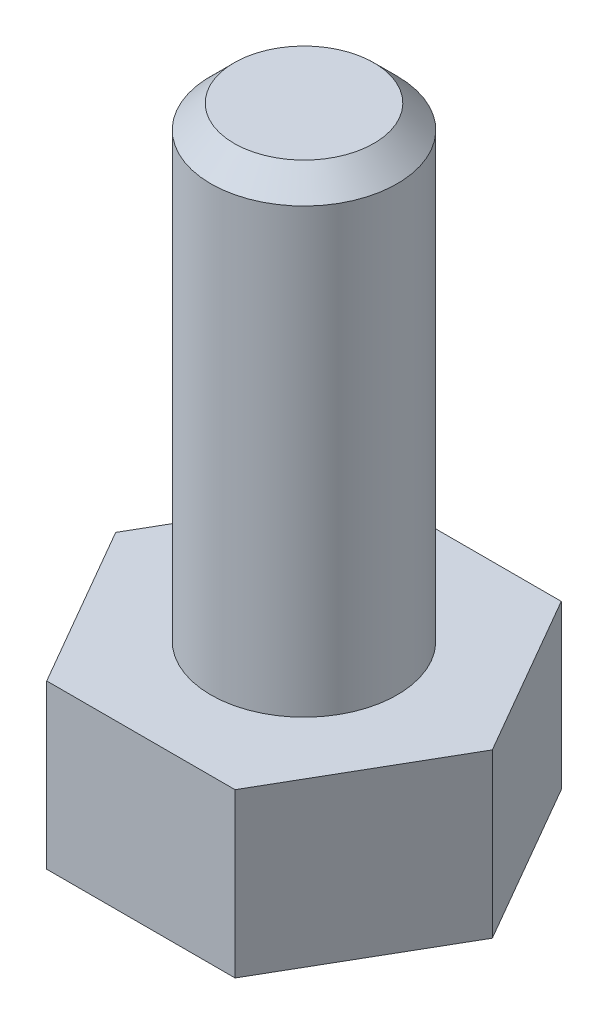
ISO-10303-21;
HEADER;
FILE_DESCRIPTION(('STEP AP214'),'2;1');
FILE_NAME('part.step','',(''),(''),'','','');
FILE_SCHEMA(('AUTOMOTIVE_DESIGN { 1 0 10303 214 1 1 1 1 }'));
ENDSEC;
DATA;
#1=APPLICATION_CONTEXT('core data for automotive mechanical design processes');
#2=APPLICATION_PROTOCOL_DEFINITION('international standard','automotive_design',2000,#1);
#3=PRODUCT_CONTEXT('',#1,'mechanical');
#4=PRODUCT('Part','Part','',(#3));
#5=PRODUCT_RELATED_PRODUCT_CATEGORY('part','',(#4));
#6=PRODUCT_DEFINITION_FORMATION('','',#4);
#7=PRODUCT_DEFINITION_CONTEXT('part definition',#1,'design');
#8=PRODUCT_DEFINITION('design','',#6,#7);
#9=PRODUCT_DEFINITION_SHAPE('','',#8);
#10=(LENGTH_UNIT() NAMED_UNIT(*) SI_UNIT(.MILLI.,.METRE.));
#11=(NAMED_UNIT(*) PLANE_ANGLE_UNIT() SI_UNIT($,.RADIAN.));
#12=(NAMED_UNIT(*) SI_UNIT($,.STERADIAN.) SOLID_ANGLE_UNIT());
#13=UNCERTAINTY_MEASURE_WITH_UNIT(LENGTH_MEASURE(1.E-05),#10,'distance_accuracy_value','');
#14=(GEOMETRIC_REPRESENTATION_CONTEXT(3) GLOBAL_UNCERTAINTY_ASSIGNED_CONTEXT((#13)) GLOBAL_UNIT_ASSIGNED_CONTEXT((#10,
#11,#12)) REPRESENTATION_CONTEXT('',''));
#15=CARTESIAN_POINT('',(0.,0.,0.));
#16=DIRECTION('',(0.,0.,1.));
#17=DIRECTION('',(1.,0.,0.));
#18=AXIS2_PLACEMENT_3D('',#15,#16,#17);
#19=CARTESIAN_POINT('',(-3.03108891324554,3.5,1.75));
#20=DIRECTION('',(0.866025403784439,0.,-0.5));
#21=DIRECTION('',(-0.5,0.,-0.866025403784439));
#22=AXIS2_PLACEMENT_3D('',#19,#20,#21);
#23=PLANE('',#22);
#24=DIRECTION('',(0.5,0.,0.866025403784439));
#25=VECTOR('',#24,1.);
#26=CARTESIAN_POINT('',(-3.03108891324554,0.,1.75));
#27=LINE('',#26,#25);
#28=CARTESIAN_POINT('',(-4.04145188432738,0.,0.));
#29=VERTEX_POINT('',#28);
#30=CARTESIAN_POINT('',(-2.02072594216369,0.,3.5));
#31=VERTEX_POINT('',#30);
#32=EDGE_CURVE('E122',#29,#31,#27,.T.);
#33=ORIENTED_EDGE('',*,*,#32,.T.);
#34=DIRECTION('',(0.,-1.,0.));
#35=VECTOR('',#34,1.);
#36=CARTESIAN_POINT('',(-2.02072594216369,3.5,3.5));
#37=LINE('',#36,#35);
#38=CARTESIAN_POINT('',(-2.02072594216369,3.5,3.5));
#39=VERTEX_POINT('',#38);
#40=EDGE_CURVE('E139',#39,#31,#37,.T.);
#41=ORIENTED_EDGE('',*,*,#40,.F.);
#42=DIRECTION('',(0.5,0.,0.866025403784439));
#43=VECTOR('',#42,1.);
#44=CARTESIAN_POINT('',(-3.03108891324554,3.5,1.75));
#45=LINE('',#44,#43);
#46=CARTESIAN_POINT('',(-4.04145188432738,3.5,0.));
#47=VERTEX_POINT('',#46);
#48=EDGE_CURVE('E132',#47,#39,#45,.T.);
#49=ORIENTED_EDGE('',*,*,#48,.F.);
#50=DIRECTION('',(0.,-1.,0.));
#51=VECTOR('',#50,1.);
#52=CARTESIAN_POINT('',(-4.04145188432738,3.5,0.));
#53=LINE('',#52,#51);
#54=EDGE_CURVE('E118',#47,#29,#53,.T.);
#55=ORIENTED_EDGE('',*,*,#54,.T.);
#56=EDGE_LOOP('',(#33,#41,#49,#55));
#57=FACE_BOUND('',#56,.T.);
#58=ADVANCED_FACE('F36',(#57),#23,.F.);
#59=CARTESIAN_POINT('',(0.,3.5,3.5));
#60=DIRECTION('',(0.,0.,-1.));
#61=DIRECTION('',(-1.,0.,0.));
#62=AXIS2_PLACEMENT_3D('',#59,#60,#61);
#63=PLANE('',#62);
#64=DIRECTION('',(1.,0.,0.));
#65=VECTOR('',#64,1.);
#66=CARTESIAN_POINT('',(0.,0.,3.5));
#67=LINE('',#66,#65);
#68=CARTESIAN_POINT('',(2.02072594216369,0.,3.5));
#69=VERTEX_POINT('',#68);
#70=EDGE_CURVE('E125',#31,#69,#67,.T.);
#71=ORIENTED_EDGE('',*,*,#70,.T.);
#72=DIRECTION('',(0.,-1.,0.));
#73=VECTOR('',#72,1.);
#74=CARTESIAN_POINT('',(2.02072594216369,3.5,3.5));
#75=LINE('',#74,#73);
#76=CARTESIAN_POINT('',(2.02072594216369,3.5,3.5));
#77=VERTEX_POINT('',#76);
#78=EDGE_CURVE('E136',#77,#69,#75,.T.);
#79=ORIENTED_EDGE('',*,*,#78,.F.);
#80=DIRECTION('',(1.,0.,0.));
#81=VECTOR('',#80,1.);
#82=CARTESIAN_POINT('',(0.,3.5,3.5));
#83=LINE('',#82,#81);
#84=EDGE_CURVE('E91',#39,#77,#83,.T.);
#85=ORIENTED_EDGE('',*,*,#84,.F.);
#86=ORIENTED_EDGE('',*,*,#40,.T.);
#87=EDGE_LOOP('',(#71,#79,#85,#86));
#88=FACE_BOUND('',#87,.T.);
#89=ADVANCED_FACE('F152',(#88),#63,.F.);
#90=CARTESIAN_POINT('',(3.03108891324554,3.5,1.75));
#91=DIRECTION('',(-0.866025403784439,0.,-0.5));
#92=DIRECTION('',(-0.5,0.,0.866025403784439));
#93=AXIS2_PLACEMENT_3D('',#90,#91,#92);
#94=PLANE('',#93);
#95=DIRECTION('',(0.5,0.,-0.866025403784439));
#96=VECTOR('',#95,1.);
#97=CARTESIAN_POINT('',(3.03108891324554,0.,1.75));
#98=LINE('',#97,#96);
#99=CARTESIAN_POINT('',(4.04145188432738,0.,0.));
#100=VERTEX_POINT('',#99);
#101=EDGE_CURVE('E127',#69,#100,#98,.T.);
#102=ORIENTED_EDGE('',*,*,#101,.T.);
#103=DIRECTION('',(0.,-1.,0.));
#104=VECTOR('',#103,1.);
#105=CARTESIAN_POINT('',(4.04145188432738,3.5,0.));
#106=LINE('',#105,#104);
#107=CARTESIAN_POINT('',(4.04145188432738,3.5,0.));
#108=VERTEX_POINT('',#107);
#109=EDGE_CURVE('E113',#108,#100,#106,.T.);
#110=ORIENTED_EDGE('',*,*,#109,.F.);
#111=DIRECTION('',(0.5,0.,-0.866025403784439));
#112=VECTOR('',#111,1.);
#113=CARTESIAN_POINT('',(3.03108891324554,3.5,1.75));
#114=LINE('',#113,#112);
#115=EDGE_CURVE('E104',#77,#108,#114,.T.);
#116=ORIENTED_EDGE('',*,*,#115,.F.);
#117=ORIENTED_EDGE('',*,*,#78,.T.);
#118=EDGE_LOOP('',(#102,#110,#116,#117));
#119=FACE_BOUND('',#118,.T.);
#120=ADVANCED_FACE('F155',(#119),#94,.F.);
#121=CARTESIAN_POINT('',(3.03108891324554,3.5,-1.75));
#122=DIRECTION('',(-0.866025403784439,0.,0.5));
#123=DIRECTION('',(0.5,0.,0.866025403784439));
#124=AXIS2_PLACEMENT_3D('',#121,#122,#123);
#125=PLANE('',#124);
#126=DIRECTION('',(-0.5,0.,-0.866025403784439));
#127=VECTOR('',#126,1.);
#128=CARTESIAN_POINT('',(3.03108891324554,0.,-1.75));
#129=LINE('',#128,#127);
#130=CARTESIAN_POINT('',(2.02072594216369,0.,-3.5));
#131=VERTEX_POINT('',#130);
#132=EDGE_CURVE('E112',#100,#131,#129,.T.);
#133=ORIENTED_EDGE('',*,*,#132,.T.);
#134=DIRECTION('',(0.,-1.,0.));
#135=VECTOR('',#134,1.);
#136=CARTESIAN_POINT('',(2.02072594216369,3.5,-3.5));
#137=LINE('',#136,#135);
#138=CARTESIAN_POINT('',(2.02072594216369,3.5,-3.5));
#139=VERTEX_POINT('',#138);
#140=EDGE_CURVE('E109',#139,#131,#137,.T.);
#141=ORIENTED_EDGE('',*,*,#140,.F.);
#142=DIRECTION('',(-0.5,0.,-0.866025403784439));
#143=VECTOR('',#142,1.);
#144=CARTESIAN_POINT('',(3.03108891324554,3.5,-1.75));
#145=LINE('',#144,#143);
#146=EDGE_CURVE('E98',#108,#139,#145,.T.);
#147=ORIENTED_EDGE('',*,*,#146,.F.);
#148=ORIENTED_EDGE('',*,*,#109,.T.);
#149=EDGE_LOOP('',(#133,#141,#147,#148));
#150=FACE_BOUND('',#149,.T.);
#151=ADVANCED_FACE('F110',(#150),#125,.F.);
#152=CARTESIAN_POINT('',(0.,3.5,-3.5));
#153=DIRECTION('',(0.,0.,1.));
#154=DIRECTION('',(1.,0.,0.));
#155=AXIS2_PLACEMENT_3D('',#152,#153,#154);
#156=PLANE('',#155);
#157=DIRECTION('',(-1.,0.,0.));
#158=VECTOR('',#157,1.);
#159=CARTESIAN_POINT('',(0.,0.,-3.5));
#160=LINE('',#159,#158);
#161=CARTESIAN_POINT('',(-2.02072594216369,0.,-3.5));
#162=VERTEX_POINT('',#161);
#163=EDGE_CURVE('E76',#131,#162,#160,.T.);
#164=ORIENTED_EDGE('',*,*,#163,.T.);
#165=DIRECTION('',(0.,-1.,0.));
#166=VECTOR('',#165,1.);
#167=CARTESIAN_POINT('',(-2.02072594216369,3.5,-3.5));
#168=LINE('',#167,#166);
#169=CARTESIAN_POINT('',(-2.02072594216369,3.5,-3.5));
#170=VERTEX_POINT('',#169);
#171=EDGE_CURVE('E114',#170,#162,#168,.T.);
#172=ORIENTED_EDGE('',*,*,#171,.F.);
#173=DIRECTION('',(-1.,0.,0.));
#174=VECTOR('',#173,1.);
#175=CARTESIAN_POINT('',(0.,3.5,-3.5));
#176=LINE('',#175,#174);
#177=EDGE_CURVE('E102',#139,#170,#176,.T.);
#178=ORIENTED_EDGE('',*,*,#177,.F.);
#179=ORIENTED_EDGE('',*,*,#140,.T.);
#180=EDGE_LOOP('',(#164,#172,#178,#179));
#181=FACE_BOUND('',#180,.T.);
#182=ADVANCED_FACE('F116',(#181),#156,.F.);
#183=CARTESIAN_POINT('',(-3.03108891324553,3.5,-1.75));
#184=DIRECTION('',(0.866025403784439,0.,0.5));
#185=DIRECTION('',(0.5,0.,-0.866025403784439));
#186=AXIS2_PLACEMENT_3D('',#183,#184,#185);
#187=PLANE('',#186);
#188=DIRECTION('',(-0.5,0.,0.866025403784439));
#189=VECTOR('',#188,1.);
#190=CARTESIAN_POINT('',(-3.03108891324553,0.,-1.75));
#191=LINE('',#190,#189);
#192=EDGE_CURVE('E82',#162,#29,#191,.T.);
#193=ORIENTED_EDGE('',*,*,#192,.T.);
#194=ORIENTED_EDGE('',*,*,#54,.F.);
#195=DIRECTION('',(-0.5,0.,0.866025403784439));
#196=VECTOR('',#195,1.);
#197=CARTESIAN_POINT('',(-3.03108891324553,3.5,-1.75));
#198=LINE('',#197,#196);
#199=EDGE_CURVE('E53',#170,#47,#198,.T.);
#200=ORIENTED_EDGE('',*,*,#199,.F.);
#201=ORIENTED_EDGE('',*,*,#171,.T.);
#202=EDGE_LOOP('',(#193,#194,#200,#201));
#203=FACE_BOUND('',#202,.T.);
#204=ADVANCED_FACE('F160',(#203),#187,.F.);
#205=CARTESIAN_POINT('',(0.,3.5,0.));
#206=DIRECTION('',(0.,1.,0.));
#207=DIRECTION('',(0.,0.,1.));
#208=AXIS2_PLACEMENT_3D('',#205,#206,#207);
#209=PLANE('',#208);
#210=CARTESIAN_POINT('',(0.,3.5,0.));
#211=DIRECTION('',(0.,1.,0.));
#212=DIRECTION('',(0.,0.,1.));
#213=AXIS2_PLACEMENT_3D('',#210,#211,#212);
#214=CIRCLE('',#213,2.);
#215=CARTESIAN_POINT('',(0.,3.5,2.));
#216=VERTEX_POINT('',#215);
#217=EDGE_CURVE('E140',#216,#216,#214,.T.);
#218=ORIENTED_EDGE('',*,*,#217,.F.);
#219=EDGE_LOOP('',(#218));
#220=FACE_BOUND('',#219,.T.);
#221=ORIENTED_EDGE('',*,*,#48,.T.);
#222=ORIENTED_EDGE('',*,*,#84,.T.);
#223=ORIENTED_EDGE('',*,*,#115,.T.);
#224=ORIENTED_EDGE('',*,*,#146,.T.);
#225=ORIENTED_EDGE('',*,*,#177,.T.);
#226=ORIENTED_EDGE('',*,*,#199,.T.);
#227=EDGE_LOOP('',(#221,#222,#223,#224,#225,#226));
#228=FACE_BOUND('',#227,.T.);
#229=ADVANCED_FACE('F100',(#220,#228),#209,.T.);
#230=CARTESIAN_POINT('',(0.,0.,0.));
#231=DIRECTION('',(0.,1.,0.));
#232=DIRECTION('',(0.,0.,1.));
#233=AXIS2_PLACEMENT_3D('',#230,#231,#232);
#234=PLANE('',#233);
#235=ORIENTED_EDGE('',*,*,#32,.F.);
#236=ORIENTED_EDGE('',*,*,#192,.F.);
#237=ORIENTED_EDGE('',*,*,#163,.F.);
#238=ORIENTED_EDGE('',*,*,#132,.F.);
#239=ORIENTED_EDGE('',*,*,#101,.F.);
#240=ORIENTED_EDGE('',*,*,#70,.F.);
#241=EDGE_LOOP('',(#235,#236,#237,#238,#239,#240));
#242=FACE_BOUND('',#241,.T.);
#243=ADVANCED_FACE('F158',(#242),#234,.F.);
#244=CARTESIAN_POINT('',(0.,13.5,0.));
#245=DIRECTION('',(0.,-1.,0.));
#246=DIRECTION('',(0.,0.,-1.));
#247=AXIS2_PLACEMENT_3D('',#244,#245,#246);
#248=CYLINDRICAL_SURFACE('',#247,2.);
#249=CARTESIAN_POINT('',(0.,13.,0.));
#250=DIRECTION('',(0.,1.,0.));
#251=DIRECTION('',(0.,0.,1.));
#252=AXIS2_PLACEMENT_3D('',#249,#250,#251);
#253=CIRCLE('',#252,2.);
#254=CARTESIAN_POINT('',(0.,13.,2.));
#255=VERTEX_POINT('',#254);
#256=EDGE_CURVE('E11',#255,#255,#253,.F.);
#257=ORIENTED_EDGE('',*,*,#256,.T.);
#258=EDGE_LOOP('',(#257));
#259=FACE_BOUND('',#258,.T.);
#260=ORIENTED_EDGE('',*,*,#217,.T.);
#261=EDGE_LOOP('',(#260));
#262=FACE_BOUND('',#261,.T.);
#263=ADVANCED_FACE('F202',(#259,#262),#248,.T.);
#264=CARTESIAN_POINT('',(0.,13.5,0.));
#265=DIRECTION('',(0.,1.,0.));
#266=DIRECTION('',(0.,0.,1.));
#267=AXIS2_PLACEMENT_3D('',#264,#265,#266);
#268=PLANE('',#267);
#269=CARTESIAN_POINT('',(0.,13.5,0.));
#270=DIRECTION('',(0.,1.,0.));
#271=DIRECTION('',(0.,0.,1.));
#272=AXIS2_PLACEMENT_3D('',#269,#270,#271);
#273=CIRCLE('',#272,1.5);
#274=CARTESIAN_POINT('',(0.,13.5,1.5));
#275=VERTEX_POINT('',#274);
#276=EDGE_CURVE('E45',#275,#275,#273,.T.);
#277=ORIENTED_EDGE('',*,*,#276,.T.);
#278=EDGE_LOOP('',(#277));
#279=FACE_BOUND('',#278,.T.);
#280=ADVANCED_FACE('F215',(#279),#268,.T.);
#281=CARTESIAN_POINT('',(0.,13.5,0.));
#282=DIRECTION('',(0.,-1.,0.));
#283=DIRECTION('',(0.,0.,-1.));
#284=AXIS2_PLACEMENT_3D('',#281,#282,#283);
#285=CONICAL_SURFACE('',#284,1.5,0.785398163397447);
#286=ORIENTED_EDGE('',*,*,#256,.F.);
#287=EDGE_LOOP('',(#286));
#288=FACE_BOUND('',#287,.T.);
#289=ORIENTED_EDGE('',*,*,#276,.F.);
#290=EDGE_LOOP('',(#289));
#291=FACE_BOUND('',#290,.T.);
#292=ADVANCED_FACE('F38',(#288,#291),#285,.T.);
#293=CLOSED_SHELL('',(#58,#89,#120,#151,#182,#204,#229,#243,#263,#280,#292));
#294=MANIFOLD_SOLID_BREP('B2',#293);
#295=ADVANCED_BREP_SHAPE_REPRESENTATION('',(#18,#294),#14);
#296=SHAPE_DEFINITION_REPRESENTATION(#9,#295);
ENDSEC;
END-ISO-10303-21;
